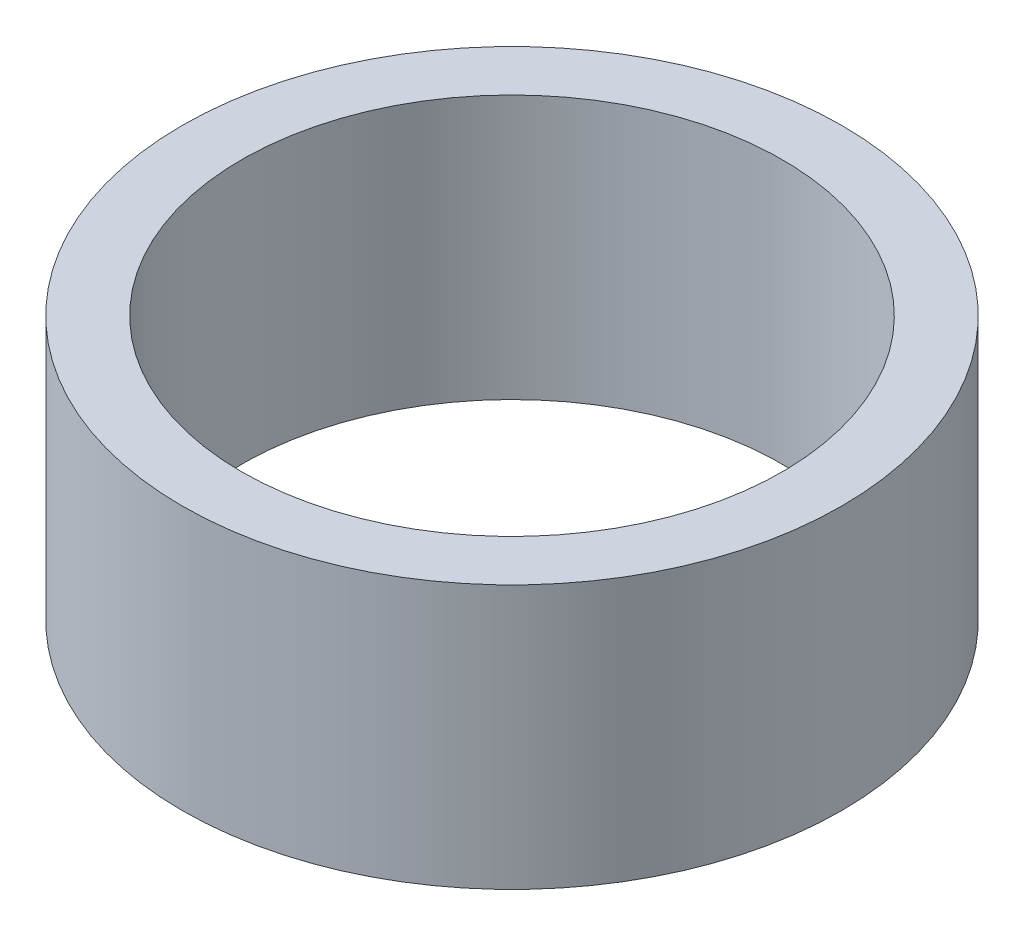
ISO-10303-21;
HEADER;
FILE_DESCRIPTION(('STEP AP214'),'2;1');
FILE_NAME('part.step','',(''),(''),'','','');
FILE_SCHEMA(('AUTOMOTIVE_DESIGN { 1 0 10303 214 1 1 1 1 }'));
ENDSEC;
DATA;
#1=APPLICATION_CONTEXT('core data for automotive mechanical design processes');
#2=APPLICATION_PROTOCOL_DEFINITION('international standard','automotive_design',2000,#1);
#3=PRODUCT_CONTEXT('',#1,'mechanical');
#4=PRODUCT('Part','Part','',(#3));
#5=PRODUCT_RELATED_PRODUCT_CATEGORY('part','',(#4));
#6=PRODUCT_DEFINITION_FORMATION('','',#4);
#7=PRODUCT_DEFINITION_CONTEXT('part definition',#1,'design');
#8=PRODUCT_DEFINITION('design','',#6,#7);
#9=PRODUCT_DEFINITION_SHAPE('','',#8);
#10=(LENGTH_UNIT() NAMED_UNIT(*) SI_UNIT(.MILLI.,.METRE.));
#11=(NAMED_UNIT(*) PLANE_ANGLE_UNIT() SI_UNIT($,.RADIAN.));
#12=(NAMED_UNIT(*) SI_UNIT($,.STERADIAN.) SOLID_ANGLE_UNIT());
#13=UNCERTAINTY_MEASURE_WITH_UNIT(LENGTH_MEASURE(1.E-05),#10,'distance_accuracy_value','');
#14=(GEOMETRIC_REPRESENTATION_CONTEXT(3) GLOBAL_UNCERTAINTY_ASSIGNED_CONTEXT((#13)) GLOBAL_UNIT_ASSIGNED_CONTEXT((#10,
#11,#12)) REPRESENTATION_CONTEXT('',''));
#15=CARTESIAN_POINT('',(0.,0.,0.));
#16=DIRECTION('',(0.,0.,1.));
#17=DIRECTION('',(1.,0.,0.));
#18=AXIS2_PLACEMENT_3D('',#15,#16,#17);
#19=CARTESIAN_POINT('',(0.,13.0095472811433,0.));
#20=DIRECTION('',(0.,1.,0.));
#21=DIRECTION('',(0.,0.,1.));
#22=AXIS2_PLACEMENT_3D('',#19,#20,#21);
#23=CYLINDRICAL_SURFACE('',#22,4.1);
#24=CARTESIAN_POINT('',(0.,-2.,0.));
#25=DIRECTION('',(0.,1.,0.));
#26=DIRECTION('',(0.,0.,1.));
#27=AXIS2_PLACEMENT_3D('',#24,#25,#26);
#28=CIRCLE('',#27,4.1);
#29=CARTESIAN_POINT('',(0.,-2.,4.1));
#30=VERTEX_POINT('',#29);
#31=EDGE_CURVE('E10',#30,#30,#28,.T.);
#32=ORIENTED_EDGE('',*,*,#31,.F.);
#33=EDGE_LOOP('',(#32));
#34=FACE_BOUND('',#33,.T.);
#35=CARTESIAN_POINT('',(0.,2.,0.));
#36=DIRECTION('',(0.,1.,0.));
#37=DIRECTION('',(0.,0.,1.));
#38=AXIS2_PLACEMENT_3D('',#35,#36,#37);
#39=CIRCLE('',#38,4.1);
#40=CARTESIAN_POINT('',(0.,2.,4.1));
#41=VERTEX_POINT('',#40);
#42=EDGE_CURVE('E43',#41,#41,#39,.T.);
#43=ORIENTED_EDGE('',*,*,#42,.T.);
#44=EDGE_LOOP('',(#43));
#45=FACE_BOUND('',#44,.T.);
#46=ADVANCED_FACE('F29',(#34,#45),#23,.F.);
#47=CARTESIAN_POINT('',(4.1,-2.,0.));
#48=DIRECTION('',(0.,1.,0.));
#49=DIRECTION('',(0.,0.,1.));
#50=AXIS2_PLACEMENT_3D('',#47,#48,#49);
#51=PLANE('',#50);
#52=CARTESIAN_POINT('',(0.,-2.,0.));
#53=DIRECTION('',(0.,1.,0.));
#54=DIRECTION('',(0.,0.,1.));
#55=AXIS2_PLACEMENT_3D('',#52,#53,#54);
#56=CIRCLE('',#55,5.);
#57=CARTESIAN_POINT('',(0.,-2.,5.));
#58=VERTEX_POINT('',#57);
#59=EDGE_CURVE('E35',#58,#58,#56,.T.);
#60=ORIENTED_EDGE('',*,*,#59,.F.);
#61=EDGE_LOOP('',(#60));
#62=FACE_BOUND('',#61,.T.);
#63=ORIENTED_EDGE('',*,*,#31,.T.);
#64=EDGE_LOOP('',(#63));
#65=FACE_BOUND('',#64,.T.);
#66=ADVANCED_FACE('F58',(#62,#65),#51,.F.);
#67=CARTESIAN_POINT('',(0.,13.0095472811433,0.));
#68=DIRECTION('',(0.,1.,0.));
#69=DIRECTION('',(0.,0.,1.));
#70=AXIS2_PLACEMENT_3D('',#67,#68,#69);
#71=CYLINDRICAL_SURFACE('',#70,5.);
#72=CARTESIAN_POINT('',(0.,2.,0.));
#73=DIRECTION('',(0.,1.,0.));
#74=DIRECTION('',(0.,0.,1.));
#75=AXIS2_PLACEMENT_3D('',#72,#73,#74);
#76=CIRCLE('',#75,5.);
#77=CARTESIAN_POINT('',(0.,2.,5.));
#78=VERTEX_POINT('',#77);
#79=EDGE_CURVE('E39',#78,#78,#76,.T.);
#80=ORIENTED_EDGE('',*,*,#79,.F.);
#81=EDGE_LOOP('',(#80));
#82=FACE_BOUND('',#81,.T.);
#83=ORIENTED_EDGE('',*,*,#59,.T.);
#84=EDGE_LOOP('',(#83));
#85=FACE_BOUND('',#84,.T.);
#86=ADVANCED_FACE('F53',(#82,#85),#71,.T.);
#87=CARTESIAN_POINT('',(4.1,2.,0.));
#88=DIRECTION('',(0.,-1.,0.));
#89=DIRECTION('',(0.,0.,-1.));
#90=AXIS2_PLACEMENT_3D('',#87,#88,#89);
#91=PLANE('',#90);
#92=ORIENTED_EDGE('',*,*,#42,.F.);
#93=EDGE_LOOP('',(#92));
#94=FACE_BOUND('',#93,.T.);
#95=ORIENTED_EDGE('',*,*,#79,.T.);
#96=EDGE_LOOP('',(#95));
#97=FACE_BOUND('',#96,.T.);
#98=ADVANCED_FACE('F50',(#94,#97),#91,.F.);
#99=CLOSED_SHELL('',(#46,#66,#86,#98));
#100=MANIFOLD_SOLID_BREP('B2',#99);
#101=ADVANCED_BREP_SHAPE_REPRESENTATION('',(#18,#100),#14);
#102=SHAPE_DEFINITION_REPRESENTATION(#9,#101);
ENDSEC;
END-ISO-10303-21;
